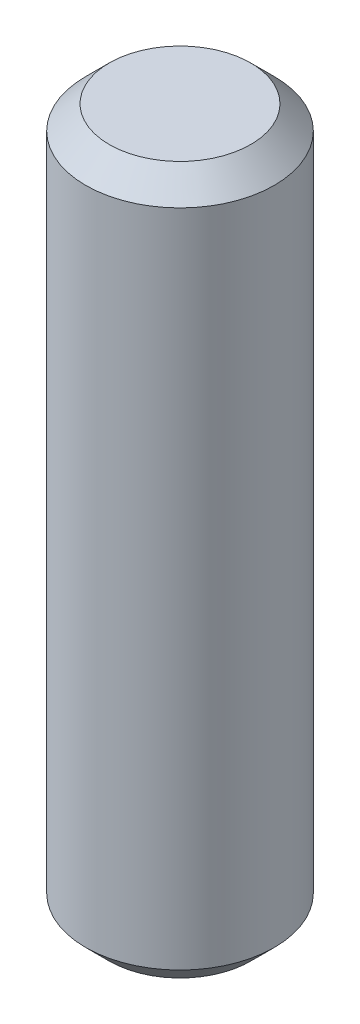
ISO-10303-21;
HEADER;
FILE_DESCRIPTION(('STEP AP214'),'2;1');
FILE_NAME('part.step','',(''),(''),'','','');
FILE_SCHEMA(('AUTOMOTIVE_DESIGN { 1 0 10303 214 1 1 1 1 }'));
ENDSEC;
DATA;
#1=APPLICATION_CONTEXT('core data for automotive mechanical design processes');
#2=APPLICATION_PROTOCOL_DEFINITION('international standard','automotive_design',2000,#1);
#3=PRODUCT_CONTEXT('',#1,'mechanical');
#4=PRODUCT('Part','Part','',(#3));
#5=PRODUCT_RELATED_PRODUCT_CATEGORY('part','',(#4));
#6=PRODUCT_DEFINITION_FORMATION('','',#4);
#7=PRODUCT_DEFINITION_CONTEXT('part definition',#1,'design');
#8=PRODUCT_DEFINITION('design','',#6,#7);
#9=PRODUCT_DEFINITION_SHAPE('','',#8);
#10=(LENGTH_UNIT() NAMED_UNIT(*) SI_UNIT(.MILLI.,.METRE.));
#11=(NAMED_UNIT(*) PLANE_ANGLE_UNIT() SI_UNIT($,.RADIAN.));
#12=(NAMED_UNIT(*) SI_UNIT($,.STERADIAN.) SOLID_ANGLE_UNIT());
#13=UNCERTAINTY_MEASURE_WITH_UNIT(LENGTH_MEASURE(1.E-05),#10,'distance_accuracy_value','');
#14=(GEOMETRIC_REPRESENTATION_CONTEXT(3) GLOBAL_UNCERTAINTY_ASSIGNED_CONTEXT((#13)) GLOBAL_UNIT_ASSIGNED_CONTEXT((#10,
#11,#12)) REPRESENTATION_CONTEXT('',''));
#15=CARTESIAN_POINT('',(0.,0.,0.));
#16=DIRECTION('',(0.,0.,1.));
#17=DIRECTION('',(1.,0.,0.));
#18=AXIS2_PLACEMENT_3D('',#15,#16,#17);
#19=CARTESIAN_POINT('',(0.,15.,0.));
#20=DIRECTION('',(0.,-1.,0.));
#21=DIRECTION('',(0.,0.,-1.));
#22=AXIS2_PLACEMENT_3D('',#19,#20,#21);
#23=CYLINDRICAL_SURFACE('',#22,4.);
#24=CARTESIAN_POINT('',(0.,-14.,0.));
#25=DIRECTION('',(0.,1.,0.));
#26=DIRECTION('',(0.,0.,1.));
#27=AXIS2_PLACEMENT_3D('',#24,#25,#26);
#28=CIRCLE('',#27,4.);
#29=CARTESIAN_POINT('',(0.,-14.,4.));
#30=VERTEX_POINT('',#29);
#31=EDGE_CURVE('E49',#30,#30,#28,.T.);
#32=ORIENTED_EDGE('',*,*,#31,.T.);
#33=EDGE_LOOP('',(#32));
#34=FACE_BOUND('',#33,.T.);
#35=CARTESIAN_POINT('',(0.,14.,0.));
#36=DIRECTION('',(0.,1.,0.));
#37=DIRECTION('',(0.,0.,1.));
#38=AXIS2_PLACEMENT_3D('',#35,#36,#37);
#39=CIRCLE('',#38,4.);
#40=CARTESIAN_POINT('',(0.,14.,4.));
#41=VERTEX_POINT('',#40);
#42=EDGE_CURVE('E53',#41,#41,#39,.F.);
#43=ORIENTED_EDGE('',*,*,#42,.T.);
#44=EDGE_LOOP('',(#43));
#45=FACE_BOUND('',#44,.T.);
#46=ADVANCED_FACE('F37',(#34,#45),#23,.T.);
#47=CARTESIAN_POINT('',(0.,15.,0.));
#48=DIRECTION('',(0.,1.,0.));
#49=DIRECTION('',(0.,0.,1.));
#50=AXIS2_PLACEMENT_3D('',#47,#48,#49);
#51=PLANE('',#50);
#52=CARTESIAN_POINT('',(0.,15.,0.));
#53=DIRECTION('',(0.,1.,0.));
#54=DIRECTION('',(0.,0.,1.));
#55=AXIS2_PLACEMENT_3D('',#52,#53,#54);
#56=CIRCLE('',#55,3.);
#57=CARTESIAN_POINT('',(0.,15.,3.));
#58=VERTEX_POINT('',#57);
#59=EDGE_CURVE('E10',#58,#58,#56,.T.);
#60=ORIENTED_EDGE('',*,*,#59,.T.);
#61=EDGE_LOOP('',(#60));
#62=FACE_BOUND('',#61,.T.);
#63=ADVANCED_FACE('F69',(#62),#51,.T.);
#64=CARTESIAN_POINT('',(0.,-15.,0.));
#65=DIRECTION('',(0.,1.,0.));
#66=DIRECTION('',(0.,0.,1.));
#67=AXIS2_PLACEMENT_3D('',#64,#65,#66);
#68=PLANE('',#67);
#69=CARTESIAN_POINT('',(0.,-15.,0.));
#70=DIRECTION('',(0.,1.,0.));
#71=DIRECTION('',(0.,0.,1.));
#72=AXIS2_PLACEMENT_3D('',#69,#70,#71);
#73=CIRCLE('',#72,2.99999999999999);
#74=CARTESIAN_POINT('',(0.,-15.,2.99999999999999));
#75=VERTEX_POINT('',#74);
#76=EDGE_CURVE('E45',#75,#75,#73,.F.);
#77=ORIENTED_EDGE('',*,*,#76,.T.);
#78=EDGE_LOOP('',(#77));
#79=FACE_BOUND('',#78,.T.);
#80=ADVANCED_FACE('F66',(#79),#68,.F.);
#81=CARTESIAN_POINT('',(0.,-14.,0.));
#82=DIRECTION('',(0.,1.,0.));
#83=DIRECTION('',(0.,0.,1.));
#84=AXIS2_PLACEMENT_3D('',#81,#82,#83);
#85=CONICAL_SURFACE('',#84,4.,0.78539816339745);
#86=ORIENTED_EDGE('',*,*,#76,.F.);
#87=EDGE_LOOP('',(#86));
#88=FACE_BOUND('',#87,.T.);
#89=ORIENTED_EDGE('',*,*,#31,.F.);
#90=EDGE_LOOP('',(#89));
#91=FACE_BOUND('',#90,.T.);
#92=ADVANCED_FACE('F62',(#88,#91),#85,.T.);
#93=CARTESIAN_POINT('',(0.,15.,0.));
#94=DIRECTION('',(0.,-1.,0.));
#95=DIRECTION('',(0.,0.,-1.));
#96=AXIS2_PLACEMENT_3D('',#93,#94,#95);
#97=CONICAL_SURFACE('',#96,3.,0.785398163397447);
#98=ORIENTED_EDGE('',*,*,#42,.F.);
#99=EDGE_LOOP('',(#98));
#100=FACE_BOUND('',#99,.T.);
#101=ORIENTED_EDGE('',*,*,#59,.F.);
#102=EDGE_LOOP('',(#101));
#103=FACE_BOUND('',#102,.T.);
#104=ADVANCED_FACE('F40',(#100,#103),#97,.T.);
#105=CLOSED_SHELL('',(#46,#63,#80,#92,#104));
#106=MANIFOLD_SOLID_BREP('B2',#105);
#107=ADVANCED_BREP_SHAPE_REPRESENTATION('',(#18,#106),#14);
#108=SHAPE_DEFINITION_REPRESENTATION(#9,#107);
ENDSEC;
END-ISO-10303-21;
